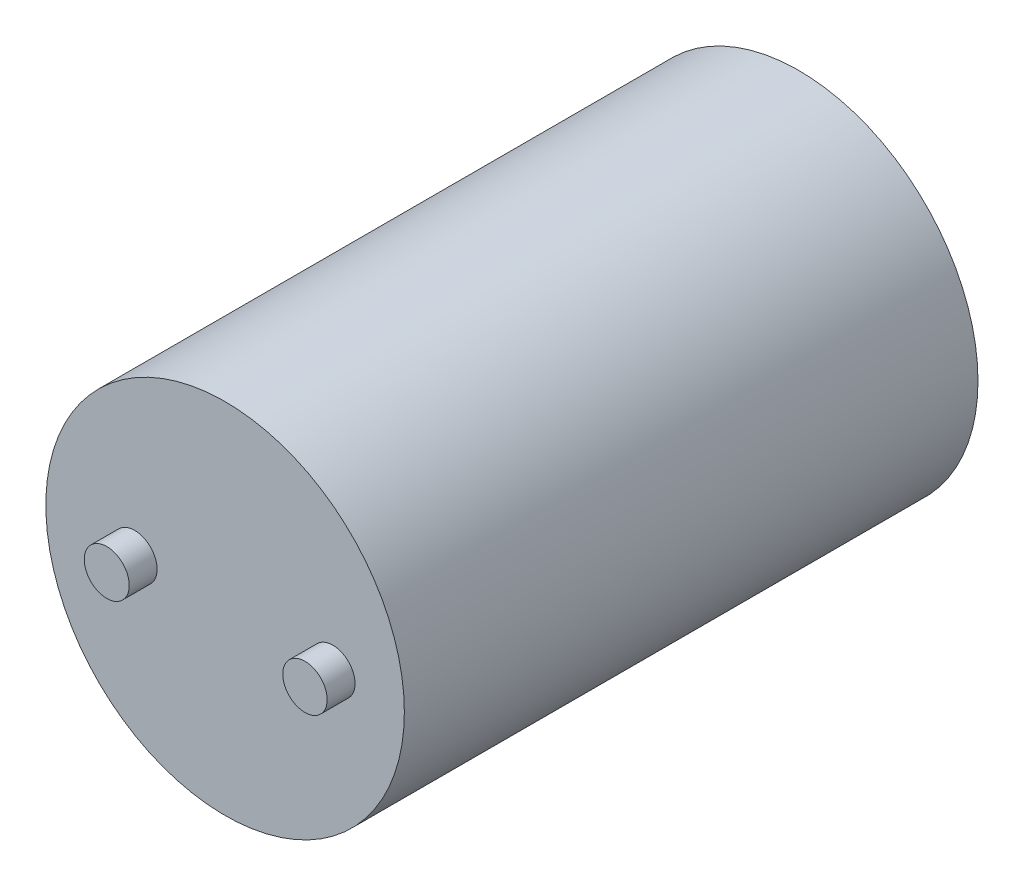
ISO-10303-21;
HEADER;
FILE_DESCRIPTION(('STEP AP214'),'2;1');
FILE_NAME('part.step','',(''),(''),'','','');
FILE_SCHEMA(('AUTOMOTIVE_DESIGN { 1 0 10303 214 1 1 1 1 }'));
ENDSEC;
DATA;
#1=APPLICATION_CONTEXT('core data for automotive mechanical design processes');
#2=APPLICATION_PROTOCOL_DEFINITION('international standard','automotive_design',2000,#1);
#3=PRODUCT_CONTEXT('',#1,'mechanical');
#4=PRODUCT('Part','Part','',(#3));
#5=PRODUCT_RELATED_PRODUCT_CATEGORY('part','',(#4));
#6=PRODUCT_DEFINITION_FORMATION('','',#4);
#7=PRODUCT_DEFINITION_CONTEXT('part definition',#1,'design');
#8=PRODUCT_DEFINITION('design','',#6,#7);
#9=PRODUCT_DEFINITION_SHAPE('','',#8);
#10=(LENGTH_UNIT() NAMED_UNIT(*) SI_UNIT(.MILLI.,.METRE.));
#11=(NAMED_UNIT(*) PLANE_ANGLE_UNIT() SI_UNIT($,.RADIAN.));
#12=(NAMED_UNIT(*) SI_UNIT($,.STERADIAN.) SOLID_ANGLE_UNIT());
#13=UNCERTAINTY_MEASURE_WITH_UNIT(LENGTH_MEASURE(1.E-05),#10,'distance_accuracy_value','');
#14=(GEOMETRIC_REPRESENTATION_CONTEXT(3) GLOBAL_UNCERTAINTY_ASSIGNED_CONTEXT((#13)) GLOBAL_UNIT_ASSIGNED_CONTEXT((#10,
#11,#12)) REPRESENTATION_CONTEXT('',''));
#15=CARTESIAN_POINT('',(0.,0.,0.));
#16=DIRECTION('',(0.,0.,1.));
#17=DIRECTION('',(1.,0.,0.));
#18=AXIS2_PLACEMENT_3D('',#15,#16,#17);
#19=CARTESIAN_POINT('',(0.,0.,144.));
#20=DIRECTION('',(0.,0.,-1.));
#21=DIRECTION('',(-1.,0.,0.));
#22=AXIS2_PLACEMENT_3D('',#19,#20,#21);
#23=CYLINDRICAL_SURFACE('',#22,45.);
#24=CARTESIAN_POINT('',(0.,0.,144.));
#25=DIRECTION('',(0.,0.,1.));
#26=DIRECTION('',(1.,0.,0.));
#27=AXIS2_PLACEMENT_3D('',#24,#25,#26);
#28=CIRCLE('',#27,45.);
#29=CARTESIAN_POINT('',(45.,0.,144.));
#30=VERTEX_POINT('',#29);
#31=EDGE_CURVE('E10',#30,#30,#28,.T.);
#32=ORIENTED_EDGE('',*,*,#31,.F.);
#33=EDGE_LOOP('',(#32));
#34=FACE_BOUND('',#33,.T.);
#35=CARTESIAN_POINT('',(0.,0.,0.));
#36=DIRECTION('',(0.,0.,1.));
#37=DIRECTION('',(1.,0.,0.));
#38=AXIS2_PLACEMENT_3D('',#35,#36,#37);
#39=CIRCLE('',#38,45.);
#40=CARTESIAN_POINT('',(45.,0.,0.));
#41=VERTEX_POINT('',#40);
#42=EDGE_CURVE('E42',#41,#41,#39,.T.);
#43=ORIENTED_EDGE('',*,*,#42,.T.);
#44=EDGE_LOOP('',(#43));
#45=FACE_BOUND('',#44,.T.);
#46=ADVANCED_FACE('F39',(#34,#45),#23,.T.);
#47=CARTESIAN_POINT('',(0.,0.,144.));
#48=DIRECTION('',(0.,0.,1.));
#49=DIRECTION('',(1.,0.,0.));
#50=AXIS2_PLACEMENT_3D('',#47,#48,#49);
#51=PLANE('',#50);
#52=CARTESIAN_POINT('',(27.0482061359026,0.,144.));
#53=DIRECTION('',(0.,0.,1.));
#54=DIRECTION('',(1.,0.,0.));
#55=AXIS2_PLACEMENT_3D('',#52,#53,#54);
#56=CIRCLE('',#55,5.57300261278186);
#57=CARTESIAN_POINT('',(32.6212087486845,0.,144.));
#58=VERTEX_POINT('',#57);
#59=EDGE_CURVE('E61',#58,#58,#56,.T.);
#60=ORIENTED_EDGE('',*,*,#59,.F.);
#61=EDGE_LOOP('',(#60));
#62=FACE_BOUND('',#61,.T.);
#63=CARTESIAN_POINT('',(-22.7100397411588,0.,144.));
#64=DIRECTION('',(0.,0.,1.));
#65=DIRECTION('',(1.,0.,0.));
#66=AXIS2_PLACEMENT_3D('',#63,#64,#65);
#67=CIRCLE('',#66,5.6450849916328);
#68=CARTESIAN_POINT('',(-17.064954749526,0.,144.));
#69=VERTEX_POINT('',#68);
#70=EDGE_CURVE('E53',#69,#69,#67,.T.);
#71=ORIENTED_EDGE('',*,*,#70,.F.);
#72=EDGE_LOOP('',(#71));
#73=FACE_BOUND('',#72,.T.);
#74=ORIENTED_EDGE('',*,*,#31,.T.);
#75=EDGE_LOOP('',(#74));
#76=FACE_BOUND('',#75,.T.);
#77=ADVANCED_FACE('F78',(#62,#73,#76),#51,.T.);
#78=CARTESIAN_POINT('',(0.,0.,0.));
#79=DIRECTION('',(0.,0.,1.));
#80=DIRECTION('',(1.,0.,0.));
#81=AXIS2_PLACEMENT_3D('',#78,#79,#80);
#82=PLANE('',#81);
#83=ORIENTED_EDGE('',*,*,#42,.F.);
#84=EDGE_LOOP('',(#83));
#85=FACE_BOUND('',#84,.T.);
#86=ADVANCED_FACE('F81',(#85),#82,.F.);
#87=CARTESIAN_POINT('',(-22.7100397411588,0.,151.));
#88=DIRECTION('',(0.,0.,-1.));
#89=DIRECTION('',(-1.,0.,0.));
#90=AXIS2_PLACEMENT_3D('',#87,#88,#89);
#91=CYLINDRICAL_SURFACE('',#90,5.6450849916328);
#92=CARTESIAN_POINT('',(-22.7100397411588,0.,151.));
#93=DIRECTION('',(0.,0.,1.));
#94=DIRECTION('',(1.,0.,0.));
#95=AXIS2_PLACEMENT_3D('',#92,#93,#94);
#96=CIRCLE('',#95,5.6450849916328);
#97=CARTESIAN_POINT('',(-17.064954749526,0.,151.));
#98=VERTEX_POINT('',#97);
#99=EDGE_CURVE('E51',#98,#98,#96,.T.);
#100=ORIENTED_EDGE('',*,*,#99,.F.);
#101=EDGE_LOOP('',(#100));
#102=FACE_BOUND('',#101,.T.);
#103=ORIENTED_EDGE('',*,*,#70,.T.);
#104=EDGE_LOOP('',(#103));
#105=FACE_BOUND('',#104,.T.);
#106=ADVANCED_FACE('F85',(#102,#105),#91,.T.);
#107=CARTESIAN_POINT('',(-22.7100397411588,0.,151.));
#108=DIRECTION('',(0.,0.,1.));
#109=DIRECTION('',(1.,0.,0.));
#110=AXIS2_PLACEMENT_3D('',#107,#108,#109);
#111=PLANE('',#110);
#112=ORIENTED_EDGE('',*,*,#99,.T.);
#113=EDGE_LOOP('',(#112));
#114=FACE_BOUND('',#113,.T.);
#115=ADVANCED_FACE('F74',(#114),#111,.T.);
#116=CARTESIAN_POINT('',(27.0482061359026,0.,151.));
#117=DIRECTION('',(0.,0.,-1.));
#118=DIRECTION('',(-1.,0.,0.));
#119=AXIS2_PLACEMENT_3D('',#116,#117,#118);
#120=CYLINDRICAL_SURFACE('',#119,5.57300261278186);
#121=CARTESIAN_POINT('',(27.0482061359026,0.,151.));
#122=DIRECTION('',(0.,0.,1.));
#123=DIRECTION('',(1.,0.,0.));
#124=AXIS2_PLACEMENT_3D('',#121,#122,#123);
#125=CIRCLE('',#124,5.57300261278186);
#126=CARTESIAN_POINT('',(32.6212087486845,0.,151.));
#127=VERTEX_POINT('',#126);
#128=EDGE_CURVE('E57',#127,#127,#125,.T.);
#129=ORIENTED_EDGE('',*,*,#128,.F.);
#130=EDGE_LOOP('',(#129));
#131=FACE_BOUND('',#130,.T.);
#132=ORIENTED_EDGE('',*,*,#59,.T.);
#133=EDGE_LOOP('',(#132));
#134=FACE_BOUND('',#133,.T.);
#135=ADVANCED_FACE('F71',(#131,#134),#120,.T.);
#136=CARTESIAN_POINT('',(27.0482061359026,0.,151.));
#137=DIRECTION('',(0.,0.,1.));
#138=DIRECTION('',(1.,0.,0.));
#139=AXIS2_PLACEMENT_3D('',#136,#137,#138);
#140=PLANE('',#139);
#141=ORIENTED_EDGE('',*,*,#128,.T.);
#142=EDGE_LOOP('',(#141));
#143=FACE_BOUND('',#142,.T.);
#144=ADVANCED_FACE('F69',(#143),#140,.T.);
#145=CLOSED_SHELL('',(#46,#77,#86,#106,#115,#135,#144));
#146=MANIFOLD_SOLID_BREP('B2',#145);
#147=ADVANCED_BREP_SHAPE_REPRESENTATION('',(#18,#146),#14);
#148=SHAPE_DEFINITION_REPRESENTATION(#9,#147);
ENDSEC;
END-ISO-10303-21;
